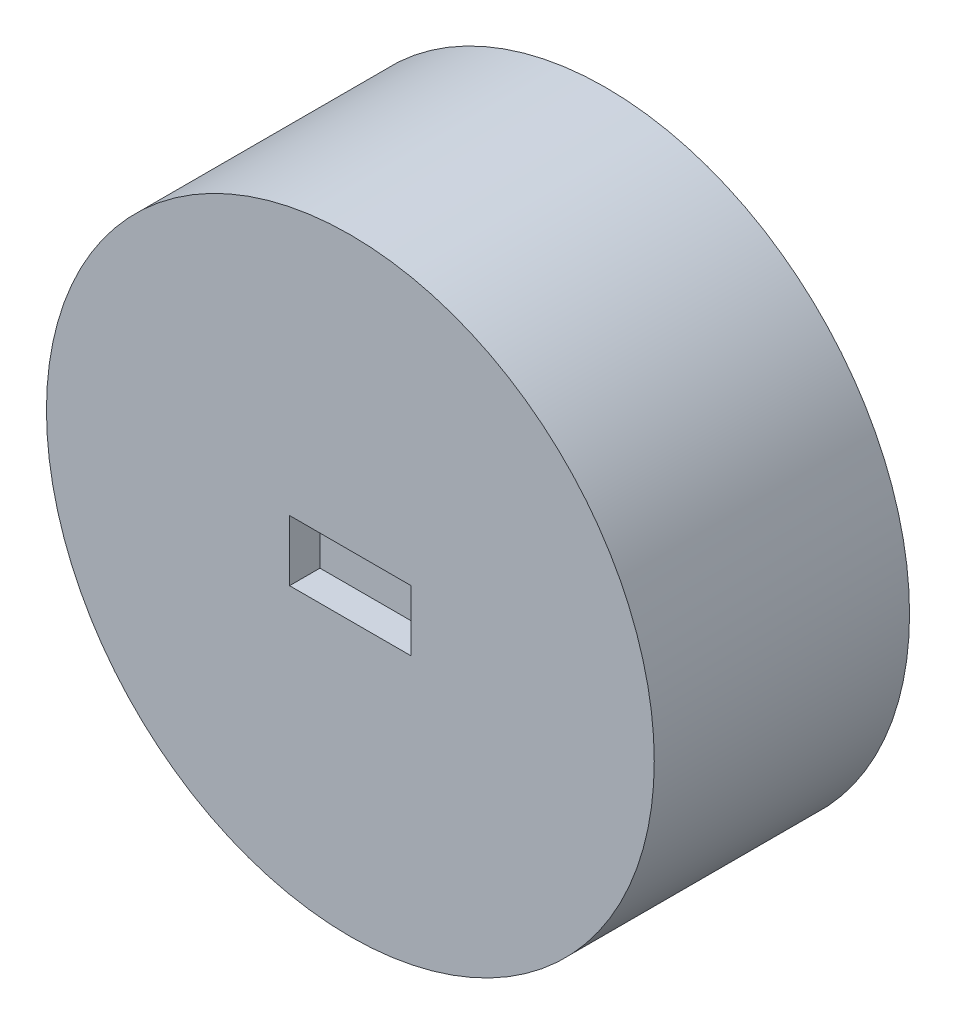
ISO-10303-21;
HEADER;
FILE_DESCRIPTION(('STEP AP214'),'2;1');
FILE_NAME('part.step','',(''),(''),'','','');
FILE_SCHEMA(('AUTOMOTIVE_DESIGN { 1 0 10303 214 1 1 1 1 }'));
ENDSEC;
DATA;
#1=APPLICATION_CONTEXT('core data for automotive mechanical design processes');
#2=APPLICATION_PROTOCOL_DEFINITION('international standard','automotive_design',2000,#1);
#3=PRODUCT_CONTEXT('',#1,'mechanical');
#4=PRODUCT('Part','Part','',(#3));
#5=PRODUCT_RELATED_PRODUCT_CATEGORY('part','',(#4));
#6=PRODUCT_DEFINITION_FORMATION('','',#4);
#7=PRODUCT_DEFINITION_CONTEXT('part definition',#1,'design');
#8=PRODUCT_DEFINITION('design','',#6,#7);
#9=PRODUCT_DEFINITION_SHAPE('','',#8);
#10=(LENGTH_UNIT() NAMED_UNIT(*) SI_UNIT(.MILLI.,.METRE.));
#11=(NAMED_UNIT(*) PLANE_ANGLE_UNIT() SI_UNIT($,.RADIAN.));
#12=(NAMED_UNIT(*) SI_UNIT($,.STERADIAN.) SOLID_ANGLE_UNIT());
#13=UNCERTAINTY_MEASURE_WITH_UNIT(LENGTH_MEASURE(1.E-05),#10,'distance_accuracy_value','');
#14=(GEOMETRIC_REPRESENTATION_CONTEXT(3) GLOBAL_UNCERTAINTY_ASSIGNED_CONTEXT((#13)) GLOBAL_UNIT_ASSIGNED_CONTEXT((#10,
#11,#12)) REPRESENTATION_CONTEXT('',''));
#15=CARTESIAN_POINT('',(0.,0.,0.));
#16=DIRECTION('',(0.,0.,1.));
#17=DIRECTION('',(1.,0.,0.));
#18=AXIS2_PLACEMENT_3D('',#15,#16,#17);
#19=CARTESIAN_POINT('',(0.,0.,42.));
#20=DIRECTION('',(0.,0.,-1.));
#21=DIRECTION('',(-1.,0.,0.));
#22=AXIS2_PLACEMENT_3D('',#19,#20,#21);
#23=CYLINDRICAL_SURFACE('',#22,50.);
#24=CARTESIAN_POINT('',(0.,0.,42.));
#25=DIRECTION('',(0.,0.,1.));
#26=DIRECTION('',(1.,0.,0.));
#27=AXIS2_PLACEMENT_3D('',#24,#25,#26);
#28=CIRCLE('',#27,50.);
#29=CARTESIAN_POINT('',(50.,0.,42.));
#30=VERTEX_POINT('',#29);
#31=EDGE_CURVE('E11',#30,#30,#28,.T.);
#32=ORIENTED_EDGE('',*,*,#31,.F.);
#33=EDGE_LOOP('',(#32));
#34=FACE_BOUND('',#33,.T.);
#35=CARTESIAN_POINT('',(0.,0.,0.));
#36=DIRECTION('',(0.,0.,1.));
#37=DIRECTION('',(1.,0.,0.));
#38=AXIS2_PLACEMENT_3D('',#35,#36,#37);
#39=CIRCLE('',#38,50.);
#40=CARTESIAN_POINT('',(50.,0.,0.));
#41=VERTEX_POINT('',#40);
#42=EDGE_CURVE('E36',#41,#41,#39,.T.);
#43=ORIENTED_EDGE('',*,*,#42,.T.);
#44=EDGE_LOOP('',(#43));
#45=FACE_BOUND('',#44,.T.);
#46=ADVANCED_FACE('F33',(#34,#45),#23,.T.);
#47=CARTESIAN_POINT('',(0.,0.,42.));
#48=DIRECTION('',(0.,0.,1.));
#49=DIRECTION('',(1.,0.,0.));
#50=AXIS2_PLACEMENT_3D('',#47,#48,#49);
#51=PLANE('',#50);
#52=DIRECTION('',(0.,1.,0.));
#53=VECTOR('',#52,1.);
#54=CARTESIAN_POINT('',(10.,-5.,42.));
#55=LINE('',#54,#53);
#56=CARTESIAN_POINT('',(10.,-5.,42.));
#57=VERTEX_POINT('',#56);
#58=CARTESIAN_POINT('',(10.,5.,42.));
#59=VERTEX_POINT('',#58);
#60=EDGE_CURVE('E47',#57,#59,#55,.T.);
#61=ORIENTED_EDGE('',*,*,#60,.F.);
#62=DIRECTION('',(1.,0.,0.));
#63=VECTOR('',#62,1.);
#64=CARTESIAN_POINT('',(-10.,-5.,42.));
#65=LINE('',#64,#63);
#66=CARTESIAN_POINT('',(-10.,-5.,42.));
#67=VERTEX_POINT('',#66);
#68=EDGE_CURVE('E98',#67,#57,#65,.T.);
#69=ORIENTED_EDGE('',*,*,#68,.F.);
#70=DIRECTION('',(0.,-1.,0.));
#71=VECTOR('',#70,1.);
#72=CARTESIAN_POINT('',(-10.,-5.,42.));
#73=LINE('',#72,#71);
#74=CARTESIAN_POINT('',(-10.,5.,42.));
#75=VERTEX_POINT('',#74);
#76=EDGE_CURVE('E104',#75,#67,#73,.T.);
#77=ORIENTED_EDGE('',*,*,#76,.F.);
#78=DIRECTION('',(-1.,0.,0.));
#79=VECTOR('',#78,1.);
#80=CARTESIAN_POINT('',(-10.,5.,42.));
#81=LINE('',#80,#79);
#82=EDGE_CURVE('E82',#59,#75,#81,.T.);
#83=ORIENTED_EDGE('',*,*,#82,.F.);
#84=EDGE_LOOP('',(#61,#69,#77,#83));
#85=FACE_BOUND('',#84,.T.);
#86=ORIENTED_EDGE('',*,*,#31,.T.);
#87=EDGE_LOOP('',(#86));
#88=FACE_BOUND('',#87,.T.);
#89=ADVANCED_FACE('F122',(#85,#88),#51,.T.);
#90=CARTESIAN_POINT('',(0.,0.,0.));
#91=DIRECTION('',(0.,0.,1.));
#92=DIRECTION('',(1.,0.,0.));
#93=AXIS2_PLACEMENT_3D('',#90,#91,#92);
#94=PLANE('',#93);
#95=CARTESIAN_POINT('',(0.,0.,0.));
#96=DIRECTION('',(0.,0.,-1.));
#97=DIRECTION('',(-1.,0.,0.));
#98=AXIS2_PLACEMENT_3D('',#95,#96,#97);
#99=CIRCLE('',#98,4.);
#100=CARTESIAN_POINT('',(-4.,0.,0.));
#101=VERTEX_POINT('',#100);
#102=EDGE_CURVE('E108',#101,#101,#99,.T.);
#103=ORIENTED_EDGE('',*,*,#102,.F.);
#104=EDGE_LOOP('',(#103));
#105=FACE_BOUND('',#104,.T.);
#106=ORIENTED_EDGE('',*,*,#42,.F.);
#107=EDGE_LOOP('',(#106));
#108=FACE_BOUND('',#107,.T.);
#109=ADVANCED_FACE('F119',(#105,#108),#94,.F.);
#110=CARTESIAN_POINT('',(0.,0.,10.));
#111=DIRECTION('',(0.,0.,-1.));
#112=DIRECTION('',(-1.,0.,0.));
#113=AXIS2_PLACEMENT_3D('',#110,#111,#112);
#114=CYLINDRICAL_SURFACE('',#113,4.);
#115=CARTESIAN_POINT('',(0.,0.,10.));
#116=DIRECTION('',(0.,0.,-1.));
#117=DIRECTION('',(-1.,0.,0.));
#118=AXIS2_PLACEMENT_3D('',#115,#116,#117);
#119=CIRCLE('',#118,4.);
#120=CARTESIAN_POINT('',(-4.,0.,10.));
#121=VERTEX_POINT('',#120);
#122=EDGE_CURVE('E111',#121,#121,#119,.T.);
#123=ORIENTED_EDGE('',*,*,#122,.F.);
#124=EDGE_LOOP('',(#123));
#125=FACE_BOUND('',#124,.T.);
#126=ORIENTED_EDGE('',*,*,#102,.T.);
#127=EDGE_LOOP('',(#126));
#128=FACE_BOUND('',#127,.T.);
#129=ADVANCED_FACE('F117',(#125,#128),#114,.F.);
#130=CARTESIAN_POINT('',(0.,0.,10.));
#131=DIRECTION('',(0.,0.,-1.));
#132=DIRECTION('',(-1.,0.,0.));
#133=AXIS2_PLACEMENT_3D('',#130,#131,#132);
#134=PLANE('',#133);
#135=ORIENTED_EDGE('',*,*,#122,.T.);
#136=EDGE_LOOP('',(#135));
#137=FACE_BOUND('',#136,.T.);
#138=ADVANCED_FACE('F140',(#137),#134,.T.);
#139=CARTESIAN_POINT('',(10.,-5.,37.));
#140=DIRECTION('',(1.,0.,0.));
#141=DIRECTION('',(0.,0.,-1.));
#142=AXIS2_PLACEMENT_3D('',#139,#140,#141);
#143=PLANE('',#142);
#144=ORIENTED_EDGE('',*,*,#60,.T.);
#145=DIRECTION('',(0.,0.,1.));
#146=VECTOR('',#145,1.);
#147=CARTESIAN_POINT('',(10.,5.,37.));
#148=LINE('',#147,#146);
#149=CARTESIAN_POINT('',(10.,5.,37.));
#150=VERTEX_POINT('',#149);
#151=EDGE_CURVE('E70',#150,#59,#148,.T.);
#152=ORIENTED_EDGE('',*,*,#151,.F.);
#153=DIRECTION('',(0.,1.,0.));
#154=VECTOR('',#153,1.);
#155=CARTESIAN_POINT('',(10.,-5.,37.));
#156=LINE('',#155,#154);
#157=CARTESIAN_POINT('',(10.,-5.,37.));
#158=VERTEX_POINT('',#157);
#159=EDGE_CURVE('E96',#158,#150,#156,.T.);
#160=ORIENTED_EDGE('',*,*,#159,.F.);
#161=DIRECTION('',(0.,0.,1.));
#162=VECTOR('',#161,1.);
#163=CARTESIAN_POINT('',(10.,-5.,37.));
#164=LINE('',#163,#162);
#165=EDGE_CURVE('E55',#158,#57,#164,.T.);
#166=ORIENTED_EDGE('',*,*,#165,.T.);
#167=EDGE_LOOP('',(#144,#152,#160,#166));
#168=FACE_BOUND('',#167,.T.);
#169=ADVANCED_FACE('F144',(#168),#143,.F.);
#170=CARTESIAN_POINT('',(-10.,-5.,37.));
#171=DIRECTION('',(0.,-1.,0.));
#172=DIRECTION('',(0.,0.,-1.));
#173=AXIS2_PLACEMENT_3D('',#170,#171,#172);
#174=PLANE('',#173);
#175=ORIENTED_EDGE('',*,*,#68,.T.);
#176=ORIENTED_EDGE('',*,*,#165,.F.);
#177=DIRECTION('',(1.,0.,0.));
#178=VECTOR('',#177,1.);
#179=CARTESIAN_POINT('',(-10.,-5.,37.));
#180=LINE('',#179,#178);
#181=CARTESIAN_POINT('',(-10.,-5.,37.));
#182=VERTEX_POINT('',#181);
#183=EDGE_CURVE('E93',#182,#158,#180,.T.);
#184=ORIENTED_EDGE('',*,*,#183,.F.);
#185=DIRECTION('',(0.,0.,1.));
#186=VECTOR('',#185,1.);
#187=CARTESIAN_POINT('',(-10.,-5.,37.));
#188=LINE('',#187,#186);
#189=EDGE_CURVE('E86',#182,#67,#188,.T.);
#190=ORIENTED_EDGE('',*,*,#189,.T.);
#191=EDGE_LOOP('',(#175,#176,#184,#190));
#192=FACE_BOUND('',#191,.T.);
#193=ADVANCED_FACE('F148',(#192),#174,.F.);
#194=CARTESIAN_POINT('',(-10.,-5.,37.));
#195=DIRECTION('',(-1.,0.,0.));
#196=DIRECTION('',(0.,0.,1.));
#197=AXIS2_PLACEMENT_3D('',#194,#195,#196);
#198=PLANE('',#197);
#199=ORIENTED_EDGE('',*,*,#76,.T.);
#200=ORIENTED_EDGE('',*,*,#189,.F.);
#201=DIRECTION('',(0.,-1.,0.));
#202=VECTOR('',#201,1.);
#203=CARTESIAN_POINT('',(-10.,-5.,37.));
#204=LINE('',#203,#202);
#205=CARTESIAN_POINT('',(-10.,5.,37.));
#206=VERTEX_POINT('',#205);
#207=EDGE_CURVE('E89',#206,#182,#204,.T.);
#208=ORIENTED_EDGE('',*,*,#207,.F.);
#209=DIRECTION('',(0.,0.,1.));
#210=VECTOR('',#209,1.);
#211=CARTESIAN_POINT('',(-10.,5.,37.));
#212=LINE('',#211,#210);
#213=EDGE_CURVE('E75',#206,#75,#212,.T.);
#214=ORIENTED_EDGE('',*,*,#213,.T.);
#215=EDGE_LOOP('',(#199,#200,#208,#214));
#216=FACE_BOUND('',#215,.T.);
#217=ADVANCED_FACE('F90',(#216),#198,.F.);
#218=CARTESIAN_POINT('',(-10.,5.,37.));
#219=DIRECTION('',(0.,1.,0.));
#220=DIRECTION('',(0.,0.,1.));
#221=AXIS2_PLACEMENT_3D('',#218,#219,#220);
#222=PLANE('',#221);
#223=ORIENTED_EDGE('',*,*,#82,.T.);
#224=ORIENTED_EDGE('',*,*,#213,.F.);
#225=DIRECTION('',(-1.,0.,0.));
#226=VECTOR('',#225,1.);
#227=CARTESIAN_POINT('',(-10.,5.,37.));
#228=LINE('',#227,#226);
#229=EDGE_CURVE('E79',#150,#206,#228,.T.);
#230=ORIENTED_EDGE('',*,*,#229,.F.);
#231=ORIENTED_EDGE('',*,*,#151,.T.);
#232=EDGE_LOOP('',(#223,#224,#230,#231));
#233=FACE_BOUND('',#232,.T.);
#234=ADVANCED_FACE('F77',(#233),#222,.F.);
#235=CARTESIAN_POINT('',(0.,0.,37.));
#236=DIRECTION('',(0.,0.,-1.));
#237=DIRECTION('',(-1.,0.,0.));
#238=AXIS2_PLACEMENT_3D('',#235,#236,#237);
#239=PLANE('',#238);
#240=ORIENTED_EDGE('',*,*,#159,.T.);
#241=ORIENTED_EDGE('',*,*,#229,.T.);
#242=ORIENTED_EDGE('',*,*,#207,.T.);
#243=ORIENTED_EDGE('',*,*,#183,.T.);
#244=EDGE_LOOP('',(#240,#241,#242,#243));
#245=FACE_BOUND('',#244,.T.);
#246=ADVANCED_FACE('F95',(#245),#239,.F.);
#247=CLOSED_SHELL('',(#46,#89,#109,#129,#138,#169,#193,#217,#234,#246));
#248=MANIFOLD_SOLID_BREP('B2',#247);
#249=ADVANCED_BREP_SHAPE_REPRESENTATION('',(#18,#248),#14);
#250=SHAPE_DEFINITION_REPRESENTATION(#9,#249);
ENDSEC;
END-ISO-10303-21;
